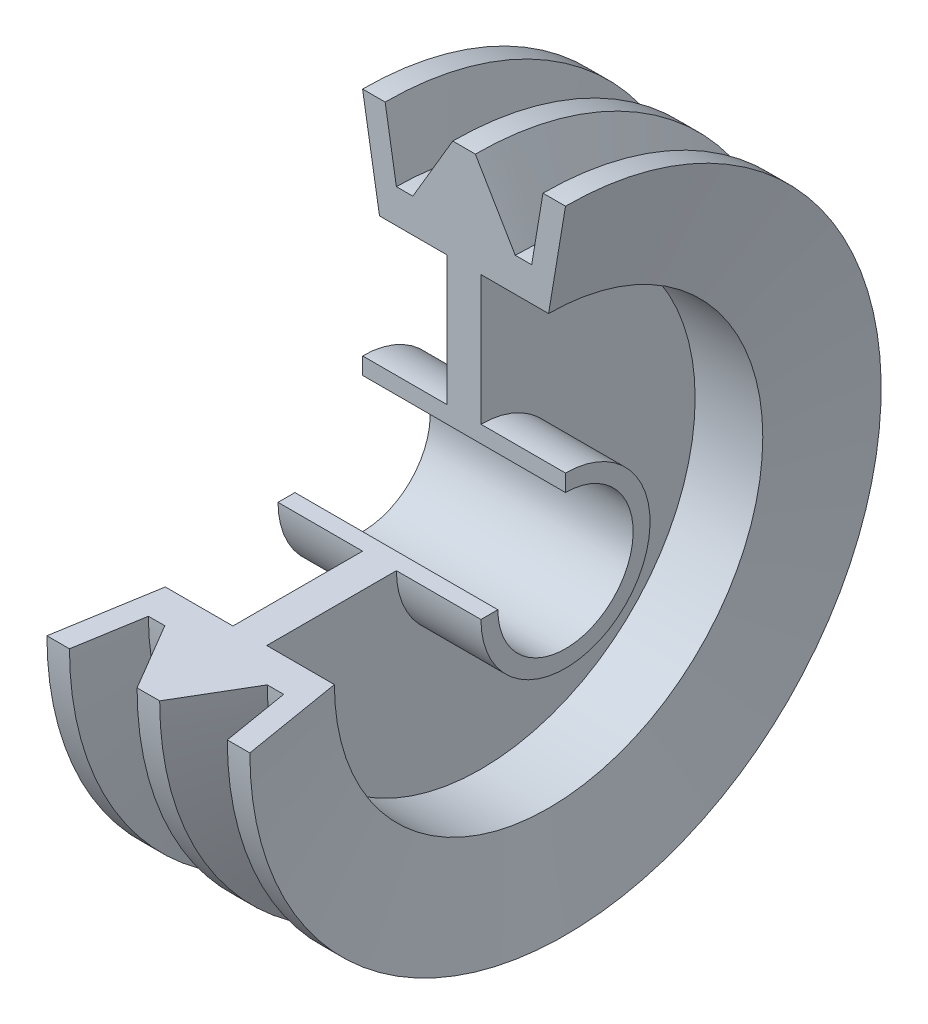
ISO-10303-21;
HEADER;
FILE_DESCRIPTION(('STEP AP214'),'2;1');
FILE_NAME('part.step','',(''),(''),'','','');
FILE_SCHEMA(('AUTOMOTIVE_DESIGN { 1 0 10303 214 1 1 1 1 }'));
ENDSEC;
DATA;
#1=APPLICATION_CONTEXT('core data for automotive mechanical design processes');
#2=APPLICATION_PROTOCOL_DEFINITION('international standard','automotive_design',2000,#1);
#3=PRODUCT_CONTEXT('',#1,'mechanical');
#4=PRODUCT('Part','Part','',(#3));
#5=PRODUCT_RELATED_PRODUCT_CATEGORY('part','',(#4));
#6=PRODUCT_DEFINITION_FORMATION('','',#4);
#7=PRODUCT_DEFINITION_CONTEXT('part definition',#1,'design');
#8=PRODUCT_DEFINITION('design','',#6,#7);
#9=PRODUCT_DEFINITION_SHAPE('','',#8);
#10=(LENGTH_UNIT() NAMED_UNIT(*) SI_UNIT(.MILLI.,.METRE.));
#11=(NAMED_UNIT(*) PLANE_ANGLE_UNIT() SI_UNIT($,.RADIAN.));
#12=(NAMED_UNIT(*) SI_UNIT($,.STERADIAN.) SOLID_ANGLE_UNIT());
#13=UNCERTAINTY_MEASURE_WITH_UNIT(LENGTH_MEASURE(1.E-05),#10,'distance_accuracy_value','');
#14=(GEOMETRIC_REPRESENTATION_CONTEXT(3) GLOBAL_UNCERTAINTY_ASSIGNED_CONTEXT((#13)) GLOBAL_UNIT_ASSIGNED_CONTEXT((#10,
#11,#12)) REPRESENTATION_CONTEXT('',''));
#15=CARTESIAN_POINT('',(0.,0.,0.));
#16=DIRECTION('',(0.,0.,1.));
#17=DIRECTION('',(1.,0.,0.));
#18=AXIS2_PLACEMENT_3D('',#15,#16,#17);
#19=CARTESIAN_POINT('',(4.55749512891831,-49.2104333124746,0.));
#20=DIRECTION('',(-1.,0.,0.));
#21=DIRECTION('',(0.,0.,1.));
#22=AXIS2_PLACEMENT_3D('',#19,#20,#21);
#23=CONICAL_SURFACE('',#22,140.016634992045,0.00166119611880422);
#24=CARTESIAN_POINT('',(4.55749512891831,-49.2104333124746,0.));
#25=DIRECTION('',(1.,0.,0.));
#26=DIRECTION('',(0.,0.,-1.));
#27=AXIS2_PLACEMENT_3D('',#24,#25,#26);
#28=CIRCLE('',#27,140.016634992045);
#29=CARTESIAN_POINT('',(4.55749512891831,-49.210433312473,140.016634992045));
#30=VERTEX_POINT('',#29);
#31=CARTESIAN_POINT('',(4.55749512891831,90.8062016795709,0.));
#32=VERTEX_POINT('',#31);
#33=EDGE_CURVE('E11',#30,#32,#28,.T.);
#34=ORIENTED_EDGE('',*,*,#33,.T.);
#35=DIRECTION('',(0.999998620214045,-0.00166119535477207,0.));
#36=VECTOR('',#35,1.);
#37=CARTESIAN_POINT('',(0.150859209005111,90.8135219727916,0.));
#38=LINE('',#37,#36);
#39=CARTESIAN_POINT('',(14.5673046642689,90.7895734075251,0.));
#40=VERTEX_POINT('',#39);
#41=EDGE_CURVE('E172',#32,#40,#38,.T.);
#42=ORIENTED_EDGE('',*,*,#41,.T.);
#43=CARTESIAN_POINT('',(14.5673046642689,-49.2104333124746,0.));
#44=DIRECTION('',(1.,0.,0.));
#45=DIRECTION('',(0.,0.,-1.));
#46=AXIS2_PLACEMENT_3D('',#43,#44,#45);
#47=CIRCLE('',#46,140.00000672);
#48=CARTESIAN_POINT('',(14.5673046642689,-49.210433312473,140.00000672));
#49=VERTEX_POINT('',#48);
#50=EDGE_CURVE('E51',#49,#40,#47,.T.);
#51=ORIENTED_EDGE('',*,*,#50,.F.);
#52=DIRECTION('',(0.999998620214045,0.,-0.00166119535477207));
#53=VECTOR('',#52,1.);
#54=CARTESIAN_POINT('',(0.150859209005111,-49.210433312473,140.023955285266));
#55=LINE('',#54,#53);
#56=EDGE_CURVE('E174',#30,#49,#55,.T.);
#57=ORIENTED_EDGE('',*,*,#56,.F.);
#58=EDGE_LOOP('',(#34,#42,#51,#57));
#59=FACE_BOUND('',#58,.T.);
#60=ADVANCED_FACE('F36',(#59),#23,.T.);
#61=CARTESIAN_POINT('',(4.55749512891831,-49.2104333124746,0.));
#62=DIRECTION('',(1.,0.,0.));
#63=DIRECTION('',(0.,0.,-1.));
#64=AXIS2_PLACEMENT_3D('',#61,#62,#63);
#65=CONICAL_SURFACE('',#64,140.016634992045,1.03781330341176);
#66=CARTESIAN_POINT('',(-13.1502523298184,-49.2104333124746,0.));
#67=DIRECTION('',(1.,0.,0.));
#68=DIRECTION('',(0.,0.,-1.));
#69=AXIS2_PLACEMENT_3D('',#66,#67,#68);
#70=CIRCLE('',#69,109.999999999997);
#71=CARTESIAN_POINT('',(-13.1502523298184,-49.2104333124733,109.999999999997));
#72=VERTEX_POINT('',#71);
#73=CARTESIAN_POINT('',(-13.1502523298184,60.789566687522,0.));
#74=VERTEX_POINT('',#73);
#75=EDGE_CURVE('E44',#72,#74,#70,.T.);
#76=ORIENTED_EDGE('',*,*,#75,.T.);
#77=DIRECTION('',(-0.508104861829758,-0.861295216162822,0.));
#78=VECTOR('',#77,1.);
#79=CARTESIAN_POINT('',(-36.358478370062,21.4489983014932,0.));
#80=LINE('',#79,#78);
#81=EDGE_CURVE('E183',#32,#74,#80,.T.);
#82=ORIENTED_EDGE('',*,*,#81,.F.);
#83=ORIENTED_EDGE('',*,*,#33,.F.);
#84=DIRECTION('',(-0.508104861829758,0.,-0.861295216162822));
#85=VECTOR('',#84,1.);
#86=CARTESIAN_POINT('',(-36.358478370062,-49.2104333124738,70.6594316139678));
#87=LINE('',#86,#85);
#88=EDGE_CURVE('E242',#30,#72,#87,.T.);
#89=ORIENTED_EDGE('',*,*,#88,.T.);
#90=EDGE_LOOP('',(#76,#82,#83,#89));
#91=FACE_BOUND('',#90,.T.);
#92=ADVANCED_FACE('F38',(#91),#65,.T.);
#93=CARTESIAN_POINT('',(-35.4425048710852,-49.2104333124746,0.));
#94=DIRECTION('',(1.,0.,0.));
#95=DIRECTION('',(0.,0.,-1.));
#96=AXIS2_PLACEMENT_3D('',#93,#94,#95);
#97=CYLINDRICAL_SURFACE('',#96,109.999999999997);
#98=CARTESIAN_POINT('',(-20.442504871083,-49.2104333124746,0.));
#99=DIRECTION('',(1.,0.,0.));
#100=DIRECTION('',(0.,0.,-1.));
#101=AXIS2_PLACEMENT_3D('',#98,#99,#100);
#102=CIRCLE('',#101,109.999999999997);
#103=CARTESIAN_POINT('',(-20.442504871083,-49.2104333124733,109.999999999997));
#104=VERTEX_POINT('',#103);
#105=CARTESIAN_POINT('',(-20.442504871083,60.789566687522,0.));
#106=VERTEX_POINT('',#105);
#107=EDGE_CURVE('E330',#104,#106,#102,.T.);
#108=ORIENTED_EDGE('',*,*,#107,.T.);
#109=DIRECTION('',(1.,0.,0.));
#110=VECTOR('',#109,1.);
#111=CARTESIAN_POINT('',(0.,60.789566687522,0.));
#112=LINE('',#111,#110);
#113=EDGE_CURVE('E188',#106,#74,#112,.T.);
#114=ORIENTED_EDGE('',*,*,#113,.T.);
#115=ORIENTED_EDGE('',*,*,#75,.F.);
#116=DIRECTION('',(1.,0.,0.));
#117=VECTOR('',#116,1.);
#118=CARTESIAN_POINT('',(0.,-49.2104333124733,109.999999999997));
#119=LINE('',#118,#117);
#120=EDGE_CURVE('E244',#104,#72,#119,.T.);
#121=ORIENTED_EDGE('',*,*,#120,.F.);
#122=EDGE_LOOP('',(#108,#114,#115,#121));
#123=FACE_BOUND('',#122,.T.);
#124=ADVANCED_FACE('F333',(#123),#97,.T.);
#125=CARTESIAN_POINT('',(-25.4425048710809,-49.2104333124746,0.));
#126=DIRECTION('',(-1.,0.,0.));
#127=DIRECTION('',(0.,0.,1.));
#128=AXIS2_PLACEMENT_3D('',#125,#126,#127);
#129=CONICAL_SURFACE('',#128,139.999999999998,1.40564764938034);
#130=CARTESIAN_POINT('',(-25.4425048710809,-49.2104333124746,0.));
#131=DIRECTION('',(1.,0.,0.));
#132=DIRECTION('',(0.,0.,-1.));
#133=AXIS2_PLACEMENT_3D('',#130,#131,#132);
#134=CIRCLE('',#133,139.999999999998);
#135=CARTESIAN_POINT('',(-25.4425048710809,-49.210433312473,139.999999999998));
#136=VERTEX_POINT('',#135);
#137=CARTESIAN_POINT('',(-25.4425048710809,90.7895666875229,0.));
#138=VERTEX_POINT('',#137);
#139=EDGE_CURVE('E328',#136,#138,#134,.T.);
#140=ORIENTED_EDGE('',*,*,#139,.T.);
#141=DIRECTION('',(0.164398987305285,-0.986393923832156,0.));
#142=VECTOR('',#141,1.);
#143=CARTESIAN_POINT('',(-10.0322371684873,-1.67203952808046,0.));
#144=LINE('',#143,#142);
#145=EDGE_CURVE('E190',#138,#106,#144,.T.);
#146=ORIENTED_EDGE('',*,*,#145,.T.);
#147=ORIENTED_EDGE('',*,*,#107,.F.);
#148=DIRECTION('',(0.164398987305285,0.,-0.986393923832156));
#149=VECTOR('',#148,1.);
#150=CARTESIAN_POINT('',(-10.0322371684873,-49.210433312474,47.5383937843941));
#151=LINE('',#150,#149);
#152=EDGE_CURVE('E247',#136,#104,#151,.T.);
#153=ORIENTED_EDGE('',*,*,#152,.F.);
#154=EDGE_LOOP('',(#140,#146,#147,#153));
#155=FACE_BOUND('',#154,.T.);
#156=ADVANCED_FACE('F338',(#155),#129,.T.);
#157=CARTESIAN_POINT('',(-35.4425048710852,-49.2104333124746,0.));
#158=DIRECTION('',(1.,0.,0.));
#159=DIRECTION('',(0.,0.,-1.));
#160=AXIS2_PLACEMENT_3D('',#157,#158,#159);
#161=CYLINDRICAL_SURFACE('',#160,139.999999999998);
#162=CARTESIAN_POINT('',(-35.4425048710809,-49.2104333124746,0.));
#163=DIRECTION('',(1.,0.,0.));
#164=DIRECTION('',(0.,0.,-1.));
#165=AXIS2_PLACEMENT_3D('',#162,#163,#164);
#166=CIRCLE('',#165,139.999999999998);
#167=CARTESIAN_POINT('',(-35.4425048710809,-49.210433312473,139.999999999998));
#168=VERTEX_POINT('',#167);
#169=CARTESIAN_POINT('',(-35.4425048710809,90.7895666875229,0.));
#170=VERTEX_POINT('',#169);
#171=EDGE_CURVE('E326',#168,#170,#166,.T.);
#172=ORIENTED_EDGE('',*,*,#171,.T.);
#173=DIRECTION('',(1.,0.,0.));
#174=VECTOR('',#173,1.);
#175=CARTESIAN_POINT('',(0.,90.7895666875229,0.));
#176=LINE('',#175,#174);
#177=EDGE_CURVE('E195',#170,#138,#176,.T.);
#178=ORIENTED_EDGE('',*,*,#177,.T.);
#179=ORIENTED_EDGE('',*,*,#139,.F.);
#180=DIRECTION('',(1.,0.,0.));
#181=VECTOR('',#180,1.);
#182=CARTESIAN_POINT('',(0.,-49.210433312473,139.999999999998));
#183=LINE('',#182,#181);
#184=EDGE_CURVE('E250',#168,#136,#183,.T.);
#185=ORIENTED_EDGE('',*,*,#184,.F.);
#186=EDGE_LOOP('',(#172,#178,#179,#185));
#187=FACE_BOUND('',#186,.T.);
#188=ADVANCED_FACE('F341',(#187),#161,.T.);
#189=CARTESIAN_POINT('',(-27.9425048710847,-49.2104333124746,0.));
#190=DIRECTION('',(-1.,0.,0.));
#191=DIRECTION('',(0.,0.,1.));
#192=AXIS2_PLACEMENT_3D('',#189,#190,#191);
#193=CONICAL_SURFACE('',#192,94.9999999999997,1.40564764938034);
#194=CARTESIAN_POINT('',(-27.9425048710847,-49.2104333124746,0.));
#195=DIRECTION('',(1.,0.,0.));
#196=DIRECTION('',(0.,0.,-1.));
#197=AXIS2_PLACEMENT_3D('',#194,#195,#196);
#198=CIRCLE('',#197,94.9999999999997);
#199=CARTESIAN_POINT('',(-27.9425048710847,-49.2104333124735,94.9999999999997));
#200=VERTEX_POINT('',#199);
#201=CARTESIAN_POINT('',(-27.9425048710847,45.7895666875252,0.));
#202=VERTEX_POINT('',#201);
#203=EDGE_CURVE('E324',#200,#202,#198,.T.);
#204=ORIENTED_EDGE('',*,*,#203,.T.);
#205=DIRECTION('',(-0.164398987305285,0.986393923832156,0.));
#206=VECTOR('',#205,1.);
#207=CARTESIAN_POINT('',(-19.7619668982172,-3.29366114970139,0.));
#208=LINE('',#207,#206);
#209=EDGE_CURVE('E198',#202,#170,#208,.T.);
#210=ORIENTED_EDGE('',*,*,#209,.T.);
#211=ORIENTED_EDGE('',*,*,#171,.F.);
#212=DIRECTION('',(-0.164398987305285,0.,0.986393923832156));
#213=VECTOR('',#212,1.);
#214=CARTESIAN_POINT('',(-19.7619668982172,-49.210433312474,45.9167721627732));
#215=LINE('',#214,#213);
#216=EDGE_CURVE('E253',#200,#168,#215,.T.);
#217=ORIENTED_EDGE('',*,*,#216,.F.);
#218=EDGE_LOOP('',(#204,#210,#211,#217));
#219=FACE_BOUND('',#218,.T.);
#220=ADVANCED_FACE('F345',(#219),#193,.F.);
#221=CARTESIAN_POINT('',(-35.4425048710852,-49.2104333124746,0.));
#222=DIRECTION('',(1.,0.,0.));
#223=DIRECTION('',(0.,0.,-1.));
#224=AXIS2_PLACEMENT_3D('',#221,#222,#223);
#225=CYLINDRICAL_SURFACE('',#224,94.9999999999997);
#226=CARTESIAN_POINT('',(2.05749512891478,-49.2104333124746,0.));
#227=DIRECTION('',(1.,0.,0.));
#228=DIRECTION('',(0.,0.,-1.));
#229=AXIS2_PLACEMENT_3D('',#226,#227,#228);
#230=CIRCLE('',#229,94.9999999999998);
#231=CARTESIAN_POINT('',(2.05749512891478,-49.2104333124735,94.9999999999998));
#232=VERTEX_POINT('',#231);
#233=CARTESIAN_POINT('',(2.05749512891478,45.7895666875252,0.));
#234=VERTEX_POINT('',#233);
#235=EDGE_CURVE('E322',#232,#234,#230,.T.);
#236=ORIENTED_EDGE('',*,*,#235,.T.);
#237=DIRECTION('',(-1.,0.,0.));
#238=VECTOR('',#237,1.);
#239=CARTESIAN_POINT('',(0.,45.7895666875252,0.));
#240=LINE('',#239,#238);
#241=EDGE_CURVE('E201',#234,#202,#240,.T.);
#242=ORIENTED_EDGE('',*,*,#241,.T.);
#243=ORIENTED_EDGE('',*,*,#203,.F.);
#244=DIRECTION('',(-1.,0.,0.));
#245=VECTOR('',#244,1.);
#246=CARTESIAN_POINT('',(0.,-49.2104333124735,94.9999999999998));
#247=LINE('',#246,#245);
#248=EDGE_CURVE('E256',#232,#200,#247,.T.);
#249=ORIENTED_EDGE('',*,*,#248,.F.);
#250=EDGE_LOOP('',(#236,#242,#243,#249));
#251=FACE_BOUND('',#250,.T.);
#252=ADVANCED_FACE('F349',(#251),#225,.F.);
#253=CARTESIAN_POINT('',(2.05749512891478,-49.210433312474,49.2104333124746));
#254=DIRECTION('',(1.,0.,0.));
#255=DIRECTION('',(0.,0.,-1.));
#256=AXIS2_PLACEMENT_3D('',#253,#254,#255);
#257=PLANE('',#256);
#258=CARTESIAN_POINT('',(2.05749512891478,-49.2104333124746,0.));
#259=DIRECTION('',(1.,0.,0.));
#260=DIRECTION('',(0.,0.,-1.));
#261=AXIS2_PLACEMENT_3D('',#258,#259,#260);
#262=CIRCLE('',#261,37.4999999999997);
#263=CARTESIAN_POINT('',(2.05749512891478,-49.2104333124741,37.4999999999997));
#264=VERTEX_POINT('',#263);
#265=CARTESIAN_POINT('',(2.05749512891478,-11.7104333124748,0.));
#266=VERTEX_POINT('',#265);
#267=EDGE_CURVE('E320',#264,#266,#262,.T.);
#268=ORIENTED_EDGE('',*,*,#267,.T.);
#269=DIRECTION('',(0.,1.,0.));
#270=VECTOR('',#269,1.);
#271=CARTESIAN_POINT('',(2.05749512891478,0.,0.));
#272=LINE('',#271,#270);
#273=EDGE_CURVE('E204',#266,#234,#272,.T.);
#274=ORIENTED_EDGE('',*,*,#273,.T.);
#275=ORIENTED_EDGE('',*,*,#235,.F.);
#276=DIRECTION('',(0.,0.,1.));
#277=VECTOR('',#276,1.);
#278=CARTESIAN_POINT('',(2.05749512891478,-49.210433312474,49.2104333124746));
#279=LINE('',#278,#277);
#280=EDGE_CURVE('E259',#264,#232,#279,.T.);
#281=ORIENTED_EDGE('',*,*,#280,.F.);
#282=EDGE_LOOP('',(#268,#274,#275,#281));
#283=FACE_BOUND('',#282,.T.);
#284=ADVANCED_FACE('F353',(#283),#257,.F.);
#285=CARTESIAN_POINT('',(-35.4425048710852,-49.2104333124746,0.));
#286=DIRECTION('',(1.,0.,0.));
#287=DIRECTION('',(0.,0.,-1.));
#288=AXIS2_PLACEMENT_3D('',#285,#286,#287);
#289=CYLINDRICAL_SURFACE('',#288,37.4999999999997);
#290=CARTESIAN_POINT('',(-35.4425048710852,-49.2104333124746,0.));
#291=DIRECTION('',(1.,0.,0.));
#292=DIRECTION('',(0.,0.,-1.));
#293=AXIS2_PLACEMENT_3D('',#290,#291,#292);
#294=CIRCLE('',#293,37.4999999999997);
#295=CARTESIAN_POINT('',(-35.4425048710852,-49.2104333124741,37.4999999999997));
#296=VERTEX_POINT('',#295);
#297=CARTESIAN_POINT('',(-35.4425048710852,-11.7104333124748,0.));
#298=VERTEX_POINT('',#297);
#299=EDGE_CURVE('E318',#296,#298,#294,.T.);
#300=ORIENTED_EDGE('',*,*,#299,.T.);
#301=DIRECTION('',(1.,0.,0.));
#302=VECTOR('',#301,1.);
#303=CARTESIAN_POINT('',(0.,-11.7104333124748,0.));
#304=LINE('',#303,#302);
#305=EDGE_CURVE('E207',#298,#266,#304,.T.);
#306=ORIENTED_EDGE('',*,*,#305,.T.);
#307=ORIENTED_EDGE('',*,*,#267,.F.);
#308=DIRECTION('',(1.,0.,0.));
#309=VECTOR('',#308,1.);
#310=CARTESIAN_POINT('',(0.,-49.2104333124741,37.4999999999997));
#311=LINE('',#310,#309);
#312=EDGE_CURVE('E262',#296,#264,#311,.T.);
#313=ORIENTED_EDGE('',*,*,#312,.F.);
#314=EDGE_LOOP('',(#300,#306,#307,#313));
#315=FACE_BOUND('',#314,.T.);
#316=ADVANCED_FACE('F357',(#315),#289,.T.);
#317=CARTESIAN_POINT('',(-35.4425048710852,-49.210433312474,49.2104333124746));
#318=DIRECTION('',(1.,0.,0.));
#319=DIRECTION('',(0.,0.,-1.));
#320=AXIS2_PLACEMENT_3D('',#317,#318,#319);
#321=PLANE('',#320);
#322=CARTESIAN_POINT('',(-35.4425048710852,-49.2104333124746,0.));
#323=DIRECTION('',(1.,0.,0.));
#324=DIRECTION('',(0.,0.,-1.));
#325=AXIS2_PLACEMENT_3D('',#322,#323,#324);
#326=CIRCLE('',#325,29.9999999999997);
#327=CARTESIAN_POINT('',(-35.4425048710852,-49.2104333124742,29.9999999999997));
#328=VERTEX_POINT('',#327);
#329=CARTESIAN_POINT('',(-35.4425048710852,-19.2104333124748,0.));
#330=VERTEX_POINT('',#329);
#331=EDGE_CURVE('E316',#328,#330,#326,.T.);
#332=ORIENTED_EDGE('',*,*,#331,.T.);
#333=DIRECTION('',(0.,1.,0.));
#334=VECTOR('',#333,1.);
#335=CARTESIAN_POINT('',(-35.4425048710852,0.,0.));
#336=LINE('',#335,#334);
#337=EDGE_CURVE('E210',#330,#298,#336,.T.);
#338=ORIENTED_EDGE('',*,*,#337,.T.);
#339=ORIENTED_EDGE('',*,*,#299,.F.);
#340=DIRECTION('',(0.,0.,1.));
#341=VECTOR('',#340,1.);
#342=CARTESIAN_POINT('',(-35.4425048710852,-49.210433312474,49.2104333124746));
#343=LINE('',#342,#341);
#344=EDGE_CURVE('E265',#328,#296,#343,.T.);
#345=ORIENTED_EDGE('',*,*,#344,.F.);
#346=EDGE_LOOP('',(#332,#338,#339,#345));
#347=FACE_BOUND('',#346,.T.);
#348=ADVANCED_FACE('F361',(#347),#321,.F.);
#349=CARTESIAN_POINT('',(-35.4425048710852,-49.2104333124746,0.));
#350=DIRECTION('',(1.,0.,0.));
#351=DIRECTION('',(0.,0.,-1.));
#352=AXIS2_PLACEMENT_3D('',#349,#350,#351);
#353=CYLINDRICAL_SURFACE('',#352,29.9999999999997);
#354=CARTESIAN_POINT('',(54.5574951289148,-49.2104333124746,0.));
#355=DIRECTION('',(1.,0.,0.));
#356=DIRECTION('',(0.,0.,-1.));
#357=AXIS2_PLACEMENT_3D('',#354,#355,#356);
#358=CIRCLE('',#357,29.9999999999997);
#359=CARTESIAN_POINT('',(54.5574951289148,-49.2104333124742,29.9999999999997));
#360=VERTEX_POINT('',#359);
#361=CARTESIAN_POINT('',(54.5574951289148,-19.2104333124748,0.));
#362=VERTEX_POINT('',#361);
#363=EDGE_CURVE('E314',#360,#362,#358,.T.);
#364=ORIENTED_EDGE('',*,*,#363,.T.);
#365=DIRECTION('',(1.,0.,0.));
#366=VECTOR('',#365,1.);
#367=CARTESIAN_POINT('',(0.,-19.2104333124748,0.));
#368=LINE('',#367,#366);
#369=EDGE_CURVE('E213',#330,#362,#368,.T.);
#370=ORIENTED_EDGE('',*,*,#369,.F.);
#371=ORIENTED_EDGE('',*,*,#331,.F.);
#372=DIRECTION('',(1.,0.,0.));
#373=VECTOR('',#372,1.);
#374=CARTESIAN_POINT('',(0.,-49.2104333124742,29.9999999999997));
#375=LINE('',#374,#373);
#376=EDGE_CURVE('E268',#328,#360,#375,.T.);
#377=ORIENTED_EDGE('',*,*,#376,.T.);
#378=EDGE_LOOP('',(#364,#370,#371,#377));
#379=FACE_BOUND('',#378,.T.);
#380=ADVANCED_FACE('F365',(#379),#353,.F.);
#381=CARTESIAN_POINT('',(54.5574951289148,-49.210433312474,49.2104333124746));
#382=DIRECTION('',(1.,0.,0.));
#383=DIRECTION('',(0.,0.,-1.));
#384=AXIS2_PLACEMENT_3D('',#381,#382,#383);
#385=PLANE('',#384);
#386=CARTESIAN_POINT('',(54.5574951289148,-49.2104333124746,0.));
#387=DIRECTION('',(1.,0.,0.));
#388=DIRECTION('',(0.,0.,-1.));
#389=AXIS2_PLACEMENT_3D('',#386,#387,#388);
#390=CIRCLE('',#389,37.4999999999997);
#391=CARTESIAN_POINT('',(54.5574951289148,-49.2104333124741,37.4999999999997));
#392=VERTEX_POINT('',#391);
#393=CARTESIAN_POINT('',(54.5574951289148,-11.7104333124748,0.));
#394=VERTEX_POINT('',#393);
#395=EDGE_CURVE('E312',#392,#394,#390,.T.);
#396=ORIENTED_EDGE('',*,*,#395,.T.);
#397=DIRECTION('',(0.,1.,0.));
#398=VECTOR('',#397,1.);
#399=CARTESIAN_POINT('',(54.5574951289148,0.,0.));
#400=LINE('',#399,#398);
#401=EDGE_CURVE('E216',#362,#394,#400,.T.);
#402=ORIENTED_EDGE('',*,*,#401,.F.);
#403=ORIENTED_EDGE('',*,*,#363,.F.);
#404=DIRECTION('',(0.,0.,1.));
#405=VECTOR('',#404,1.);
#406=CARTESIAN_POINT('',(54.5574951289148,-49.210433312474,49.2104333124746));
#407=LINE('',#406,#405);
#408=EDGE_CURVE('E271',#360,#392,#407,.T.);
#409=ORIENTED_EDGE('',*,*,#408,.T.);
#410=EDGE_LOOP('',(#396,#402,#403,#409));
#411=FACE_BOUND('',#410,.T.);
#412=ADVANCED_FACE('F370',(#411),#385,.T.);
#413=CARTESIAN_POINT('',(-35.4425048710852,-49.2104333124746,0.));
#414=DIRECTION('',(1.,0.,0.));
#415=DIRECTION('',(0.,0.,-1.));
#416=AXIS2_PLACEMENT_3D('',#413,#414,#415);
#417=CYLINDRICAL_SURFACE('',#416,37.4999999999997);
#418=CARTESIAN_POINT('',(17.0574951289162,-49.2104333124746,0.));
#419=DIRECTION('',(1.,0.,0.));
#420=DIRECTION('',(0.,0.,-1.));
#421=AXIS2_PLACEMENT_3D('',#418,#419,#420);
#422=CIRCLE('',#421,37.4999999999997);
#423=CARTESIAN_POINT('',(17.0574951289162,-49.2104333124741,37.4999999999997));
#424=VERTEX_POINT('',#423);
#425=CARTESIAN_POINT('',(17.0574951289162,-11.7104333124748,0.));
#426=VERTEX_POINT('',#425);
#427=EDGE_CURVE('E310',#424,#426,#422,.T.);
#428=ORIENTED_EDGE('',*,*,#427,.T.);
#429=DIRECTION('',(-1.,0.,0.));
#430=VECTOR('',#429,1.);
#431=CARTESIAN_POINT('',(0.,-11.7104333124748,0.));
#432=LINE('',#431,#430);
#433=EDGE_CURVE('E219',#394,#426,#432,.T.);
#434=ORIENTED_EDGE('',*,*,#433,.F.);
#435=ORIENTED_EDGE('',*,*,#395,.F.);
#436=DIRECTION('',(-1.,0.,0.));
#437=VECTOR('',#436,1.);
#438=CARTESIAN_POINT('',(0.,-49.2104333124741,37.4999999999997));
#439=LINE('',#438,#437);
#440=EDGE_CURVE('E274',#392,#424,#439,.T.);
#441=ORIENTED_EDGE('',*,*,#440,.T.);
#442=EDGE_LOOP('',(#428,#434,#435,#441));
#443=FACE_BOUND('',#442,.T.);
#444=ADVANCED_FACE('F373',(#443),#417,.T.);
#445=CARTESIAN_POINT('',(17.0574951289162,-49.210433312474,49.2104333124746));
#446=DIRECTION('',(1.,0.,0.));
#447=DIRECTION('',(0.,0.,-1.));
#448=AXIS2_PLACEMENT_3D('',#445,#446,#447);
#449=PLANE('',#448);
#450=CARTESIAN_POINT('',(17.0574951289162,-49.2104333124746,0.));
#451=DIRECTION('',(1.,0.,0.));
#452=DIRECTION('',(0.,0.,-1.));
#453=AXIS2_PLACEMENT_3D('',#450,#451,#452);
#454=CIRCLE('',#453,95.0000000000072);
#455=CARTESIAN_POINT('',(17.0574951289162,-49.2104333124735,95.0000000000072));
#456=VERTEX_POINT('',#455);
#457=CARTESIAN_POINT('',(17.0574951289162,45.7895666875327,0.));
#458=VERTEX_POINT('',#457);
#459=EDGE_CURVE('E308',#456,#458,#454,.T.);
#460=ORIENTED_EDGE('',*,*,#459,.T.);
#461=DIRECTION('',(0.,1.,0.));
#462=VECTOR('',#461,1.);
#463=CARTESIAN_POINT('',(17.0574951289162,0.,0.));
#464=LINE('',#463,#462);
#465=EDGE_CURVE('E222',#426,#458,#464,.T.);
#466=ORIENTED_EDGE('',*,*,#465,.F.);
#467=ORIENTED_EDGE('',*,*,#427,.F.);
#468=DIRECTION('',(0.,0.,1.));
#469=VECTOR('',#468,1.);
#470=CARTESIAN_POINT('',(17.0574951289162,-49.210433312474,49.2104333124746));
#471=LINE('',#470,#469);
#472=EDGE_CURVE('E277',#424,#456,#471,.T.);
#473=ORIENTED_EDGE('',*,*,#472,.T.);
#474=EDGE_LOOP('',(#460,#466,#467,#473));
#475=FACE_BOUND('',#474,.T.);
#476=ADVANCED_FACE('F378',(#475),#449,.T.);
#477=CARTESIAN_POINT('',(-35.4425048710852,-49.2104333124746,0.));
#478=DIRECTION('',(1.,0.,0.));
#479=DIRECTION('',(0.,0.,-1.));
#480=AXIS2_PLACEMENT_3D('',#477,#478,#479);
#481=CYLINDRICAL_SURFACE('',#480,95.0000000000072);
#482=CARTESIAN_POINT('',(47.0574951289266,-49.2104333124746,0.));
#483=DIRECTION('',(1.,0.,0.));
#484=DIRECTION('',(0.,0.,-1.));
#485=AXIS2_PLACEMENT_3D('',#482,#483,#484);
#486=CIRCLE('',#485,95.0000000000072);
#487=CARTESIAN_POINT('',(47.0574951289266,-49.2104333124735,95.0000000000072));
#488=VERTEX_POINT('',#487);
#489=CARTESIAN_POINT('',(47.0574951289266,45.7895666875327,0.));
#490=VERTEX_POINT('',#489);
#491=EDGE_CURVE('E306',#488,#490,#486,.T.);
#492=ORIENTED_EDGE('',*,*,#491,.T.);
#493=DIRECTION('',(1.,0.,0.));
#494=VECTOR('',#493,1.);
#495=CARTESIAN_POINT('',(0.,45.7895666875327,0.));
#496=LINE('',#495,#494);
#497=EDGE_CURVE('E225',#458,#490,#496,.T.);
#498=ORIENTED_EDGE('',*,*,#497,.F.);
#499=ORIENTED_EDGE('',*,*,#459,.F.);
#500=DIRECTION('',(1.,0.,0.));
#501=VECTOR('',#500,1.);
#502=CARTESIAN_POINT('',(0.,-49.2104333124735,95.0000000000072));
#503=LINE('',#502,#501);
#504=EDGE_CURVE('E280',#456,#488,#503,.T.);
#505=ORIENTED_EDGE('',*,*,#504,.T.);
#506=EDGE_LOOP('',(#492,#498,#499,#505));
#507=FACE_BOUND('',#506,.T.);
#508=ADVANCED_FACE('F381',(#507),#481,.F.);
#509=CARTESIAN_POINT('',(54.5574951289169,-49.2104333124746,0.));
#510=DIRECTION('',(1.,0.,0.));
#511=DIRECTION('',(0.,0.,-1.));
#512=AXIS2_PLACEMENT_3D('',#509,#510,#511);
#513=CONICAL_SURFACE('',#512,140.000000000009,1.40564764938048);
#514=CARTESIAN_POINT('',(54.5574951289169,-49.2104333124746,0.));
#515=DIRECTION('',(1.,0.,0.));
#516=DIRECTION('',(0.,0.,-1.));
#517=AXIS2_PLACEMENT_3D('',#514,#515,#516);
#518=CIRCLE('',#517,140.000000000009);
#519=CARTESIAN_POINT('',(54.5574951289169,-49.210433312473,140.000000000009));
#520=VERTEX_POINT('',#519);
#521=CARTESIAN_POINT('',(54.5574951289169,90.789566687534,0.));
#522=VERTEX_POINT('',#521);
#523=EDGE_CURVE('E304',#520,#522,#518,.T.);
#524=ORIENTED_EDGE('',*,*,#523,.T.);
#525=DIRECTION('',(-0.164398987305145,-0.986393923832179,0.));
#526=VECTOR('',#525,1.);
#527=CARTESIAN_POINT('',(38.3603357977467,-6.39338929961597,0.));
#528=LINE('',#527,#526);
#529=EDGE_CURVE('E228',#522,#490,#528,.T.);
#530=ORIENTED_EDGE('',*,*,#529,.T.);
#531=ORIENTED_EDGE('',*,*,#491,.F.);
#532=DIRECTION('',(-0.164398987305145,0.,-0.986393923832179));
#533=VECTOR('',#532,1.);
#534=CARTESIAN_POINT('',(38.3603357977467,-49.2104333124741,42.8170440128586));
#535=LINE('',#534,#533);
#536=EDGE_CURVE('E283',#520,#488,#535,.T.);
#537=ORIENTED_EDGE('',*,*,#536,.F.);
#538=EDGE_LOOP('',(#524,#530,#531,#537));
#539=FACE_BOUND('',#538,.T.);
#540=ADVANCED_FACE('F385',(#539),#513,.F.);
#541=CARTESIAN_POINT('',(-35.4425048710852,-49.2104333124746,0.));
#542=DIRECTION('',(1.,0.,0.));
#543=DIRECTION('',(0.,0.,-1.));
#544=AXIS2_PLACEMENT_3D('',#541,#542,#543);
#545=CYLINDRICAL_SURFACE('',#544,140.000000000009);
#546=CARTESIAN_POINT('',(44.5574951289193,-49.2104333124746,0.));
#547=DIRECTION('',(1.,0.,0.));
#548=DIRECTION('',(0.,0.,-1.));
#549=AXIS2_PLACEMENT_3D('',#546,#547,#548);
#550=CIRCLE('',#549,140.000000000009);
#551=CARTESIAN_POINT('',(44.5574951289193,-49.210433312473,140.000000000009));
#552=VERTEX_POINT('',#551);
#553=CARTESIAN_POINT('',(44.5574951289193,90.789566687534,0.));
#554=VERTEX_POINT('',#553);
#555=EDGE_CURVE('E302',#552,#554,#550,.T.);
#556=ORIENTED_EDGE('',*,*,#555,.T.);
#557=DIRECTION('',(-1.,0.,0.));
#558=VECTOR('',#557,1.);
#559=CARTESIAN_POINT('',(0.,90.789566687534,0.));
#560=LINE('',#559,#558);
#561=EDGE_CURVE('E231',#522,#554,#560,.T.);
#562=ORIENTED_EDGE('',*,*,#561,.F.);
#563=ORIENTED_EDGE('',*,*,#523,.F.);
#564=DIRECTION('',(-1.,0.,0.));
#565=VECTOR('',#564,1.);
#566=CARTESIAN_POINT('',(0.,-49.210433312473,140.000000000009));
#567=LINE('',#566,#565);
#568=EDGE_CURVE('E286',#520,#552,#567,.T.);
#569=ORIENTED_EDGE('',*,*,#568,.T.);
#570=EDGE_LOOP('',(#556,#562,#563,#569));
#571=FACE_BOUND('',#570,.T.);
#572=ADVANCED_FACE('F389',(#571),#545,.T.);
#573=CARTESIAN_POINT('',(44.5574951289193,-49.2104333124746,0.));
#574=DIRECTION('',(1.,0.,0.));
#575=DIRECTION('',(0.,0.,-1.));
#576=AXIS2_PLACEMENT_3D('',#573,#574,#575);
#577=CONICAL_SURFACE('',#576,140.000000000009,1.40564764938049);
#578=CARTESIAN_POINT('',(39.557495128924,-49.2104333124746,0.));
#579=DIRECTION('',(1.,0.,0.));
#580=DIRECTION('',(0.,0.,-1.));
#581=AXIS2_PLACEMENT_3D('',#578,#579,#580);
#582=CIRCLE('',#581,109.999999999997);
#583=CARTESIAN_POINT('',(39.557495128924,-49.2104333124733,109.999999999997));
#584=VERTEX_POINT('',#583);
#585=CARTESIAN_POINT('',(39.557495128924,60.789566687522,0.));
#586=VERTEX_POINT('',#585);
#587=EDGE_CURVE('E300',#584,#586,#582,.T.);
#588=ORIENTED_EDGE('',*,*,#587,.T.);
#589=DIRECTION('',(-0.164398987305141,-0.98639392383218,0.));
#590=VECTOR('',#589,1.);
#591=CARTESIAN_POINT('',(28.630606068019,-4.77176767799673,0.));
#592=LINE('',#591,#590);
#593=EDGE_CURVE('E234',#554,#586,#592,.T.);
#594=ORIENTED_EDGE('',*,*,#593,.F.);
#595=ORIENTED_EDGE('',*,*,#555,.F.);
#596=DIRECTION('',(-0.164398987305141,0.,-0.98639392383218));
#597=VECTOR('',#596,1.);
#598=CARTESIAN_POINT('',(28.630606068019,-49.2104333124741,44.4386656344778));
#599=LINE('',#598,#597);
#600=EDGE_CURVE('E289',#552,#584,#599,.T.);
#601=ORIENTED_EDGE('',*,*,#600,.T.);
#602=EDGE_LOOP('',(#588,#594,#595,#601));
#603=FACE_BOUND('',#602,.T.);
#604=ADVANCED_FACE('F393',(#603),#577,.T.);
#605=CARTESIAN_POINT('',(-35.4425048710852,-49.2104333124746,0.));
#606=DIRECTION('',(1.,0.,0.));
#607=DIRECTION('',(0.,0.,-1.));
#608=AXIS2_PLACEMENT_3D('',#605,#606,#607);
#609=CYLINDRICAL_SURFACE('',#608,109.999999999997);
#610=CARTESIAN_POINT('',(32.2652425876613,-49.2104333124746,0.));
#611=DIRECTION('',(1.,0.,0.));
#612=DIRECTION('',(0.,0.,-1.));
#613=AXIS2_PLACEMENT_3D('',#610,#611,#612);
#614=CIRCLE('',#613,109.999999999997);
#615=CARTESIAN_POINT('',(32.2652425876613,-49.2104333124733,109.999999999997));
#616=VERTEX_POINT('',#615);
#617=CARTESIAN_POINT('',(32.2652425876613,60.7895666875227,0.));
#618=VERTEX_POINT('',#617);
#619=EDGE_CURVE('E59',#616,#618,#614,.T.);
#620=ORIENTED_EDGE('',*,*,#619,.T.);
#621=DIRECTION('',(1.,0.,0.));
#622=VECTOR('',#621,1.);
#623=CARTESIAN_POINT('',(5.49517085093135E-12,60.7895666875256,0.));
#624=LINE('',#623,#622);
#625=EDGE_CURVE('E237',#618,#586,#624,.T.);
#626=ORIENTED_EDGE('',*,*,#625,.T.);
#627=ORIENTED_EDGE('',*,*,#587,.F.);
#628=DIRECTION('',(1.,0.,0.));
#629=VECTOR('',#628,1.);
#630=CARTESIAN_POINT('',(5.49517085093135E-12,-49.2104333124733,110.));
#631=LINE('',#630,#629);
#632=EDGE_CURVE('E292',#616,#584,#631,.T.);
#633=ORIENTED_EDGE('',*,*,#632,.F.);
#634=EDGE_LOOP('',(#620,#626,#627,#633));
#635=FACE_BOUND('',#634,.T.);
#636=ADVANCED_FACE('F395',(#635),#609,.T.);
#637=CARTESIAN_POINT('',(14.5673046642689,-49.2104333124746,0.));
#638=DIRECTION('',(-1.,0.,0.));
#639=DIRECTION('',(0.,0.,1.));
#640=AXIS2_PLACEMENT_3D('',#637,#638,#639);
#641=CONICAL_SURFACE('',#640,140.00000672,1.0378133034116);
#642=DIRECTION('',(0.5081048618299,0.,-0.861295216162738));
#643=VECTOR('',#642,1.);
#644=CARTESIAN_POINT('',(50.538541068037,-49.2104333124737,79.0246920527759));
#645=LINE('',#644,#643);
#646=EDGE_CURVE('E295',#49,#616,#645,.T.);
#647=ORIENTED_EDGE('',*,*,#646,.F.);
#648=ORIENTED_EDGE('',*,*,#50,.T.);
#649=DIRECTION('',(0.5081048618299,-0.861295216162738,0.));
#650=VECTOR('',#649,1.);
#651=CARTESIAN_POINT('',(50.538541068037,29.8142587403014,0.));
#652=LINE('',#651,#650);
#653=EDGE_CURVE('E186',#40,#618,#652,.T.);
#654=ORIENTED_EDGE('',*,*,#653,.T.);
#655=ORIENTED_EDGE('',*,*,#619,.F.);
#656=EDGE_LOOP('',(#647,#648,#654,#655));
#657=FACE_BOUND('',#656,.T.);
#658=ADVANCED_FACE('F396',(#657),#641,.T.);
#659=CARTESIAN_POINT('',(0.,-49.210433312474,49.2104333124746));
#660=DIRECTION('',(0.,-1.,0.));
#661=DIRECTION('',(1.,0.,0.));
#662=AXIS2_PLACEMENT_3D('',#659,#660,#661);
#663=PLANE('',#662);
#664=ORIENTED_EDGE('',*,*,#56,.T.);
#665=ORIENTED_EDGE('',*,*,#646,.T.);
#666=ORIENTED_EDGE('',*,*,#632,.T.);
#667=ORIENTED_EDGE('',*,*,#600,.F.);
#668=ORIENTED_EDGE('',*,*,#568,.F.);
#669=ORIENTED_EDGE('',*,*,#536,.T.);
#670=ORIENTED_EDGE('',*,*,#504,.F.);
#671=ORIENTED_EDGE('',*,*,#472,.F.);
#672=ORIENTED_EDGE('',*,*,#440,.F.);
#673=ORIENTED_EDGE('',*,*,#408,.F.);
#674=ORIENTED_EDGE('',*,*,#376,.F.);
#675=ORIENTED_EDGE('',*,*,#344,.T.);
#676=ORIENTED_EDGE('',*,*,#312,.T.);
#677=ORIENTED_EDGE('',*,*,#280,.T.);
#678=ORIENTED_EDGE('',*,*,#248,.T.);
#679=ORIENTED_EDGE('',*,*,#216,.T.);
#680=ORIENTED_EDGE('',*,*,#184,.T.);
#681=ORIENTED_EDGE('',*,*,#152,.T.);
#682=ORIENTED_EDGE('',*,*,#120,.T.);
#683=ORIENTED_EDGE('',*,*,#88,.F.);
#684=EDGE_LOOP('',(#664,#665,#666,#667,#668,#669,#670,#671,#672,#673,#674,#675,#676,#677,#678,
#679,#680,#681,#682,#683));
#685=FACE_BOUND('',#684,.T.);
#686=ADVANCED_FACE('F398',(#685),#663,.F.);
#687=CARTESIAN_POINT('',(0.,0.,0.));
#688=DIRECTION('',(0.,0.,1.));
#689=DIRECTION('',(1.,0.,0.));
#690=AXIS2_PLACEMENT_3D('',#687,#688,#689);
#691=PLANE('',#690);
#692=ORIENTED_EDGE('',*,*,#41,.F.);
#693=ORIENTED_EDGE('',*,*,#81,.T.);
#694=ORIENTED_EDGE('',*,*,#113,.F.);
#695=ORIENTED_EDGE('',*,*,#145,.F.);
#696=ORIENTED_EDGE('',*,*,#177,.F.);
#697=ORIENTED_EDGE('',*,*,#209,.F.);
#698=ORIENTED_EDGE('',*,*,#241,.F.);
#699=ORIENTED_EDGE('',*,*,#273,.F.);
#700=ORIENTED_EDGE('',*,*,#305,.F.);
#701=ORIENTED_EDGE('',*,*,#337,.F.);
#702=ORIENTED_EDGE('',*,*,#369,.T.);
#703=ORIENTED_EDGE('',*,*,#401,.T.);
#704=ORIENTED_EDGE('',*,*,#433,.T.);
#705=ORIENTED_EDGE('',*,*,#465,.T.);
#706=ORIENTED_EDGE('',*,*,#497,.T.);
#707=ORIENTED_EDGE('',*,*,#529,.F.);
#708=ORIENTED_EDGE('',*,*,#561,.T.);
#709=ORIENTED_EDGE('',*,*,#593,.T.);
#710=ORIENTED_EDGE('',*,*,#625,.F.);
#711=ORIENTED_EDGE('',*,*,#653,.F.);
#712=EDGE_LOOP('',(#692,#693,#694,#695,#696,#697,#698,#699,#700,#701,#702,#703,#704,#705,#706,
#707,#708,#709,#710,#711));
#713=FACE_BOUND('',#712,.T.);
#714=ADVANCED_FACE('F181',(#713),#691,.T.);
#715=CLOSED_SHELL('',(#60,#92,#124,#156,#188,#220,#252,#284,#316,#348,#380,#412,#444,#476,#508,
#540,#572,#604,#636,#658,#686,#714));
#716=MANIFOLD_SOLID_BREP('B2',#715);
#717=ADVANCED_BREP_SHAPE_REPRESENTATION('',(#18,#716),#14);
#718=SHAPE_DEFINITION_REPRESENTATION(#9,#717);
ENDSEC;
END-ISO-10303-21;
